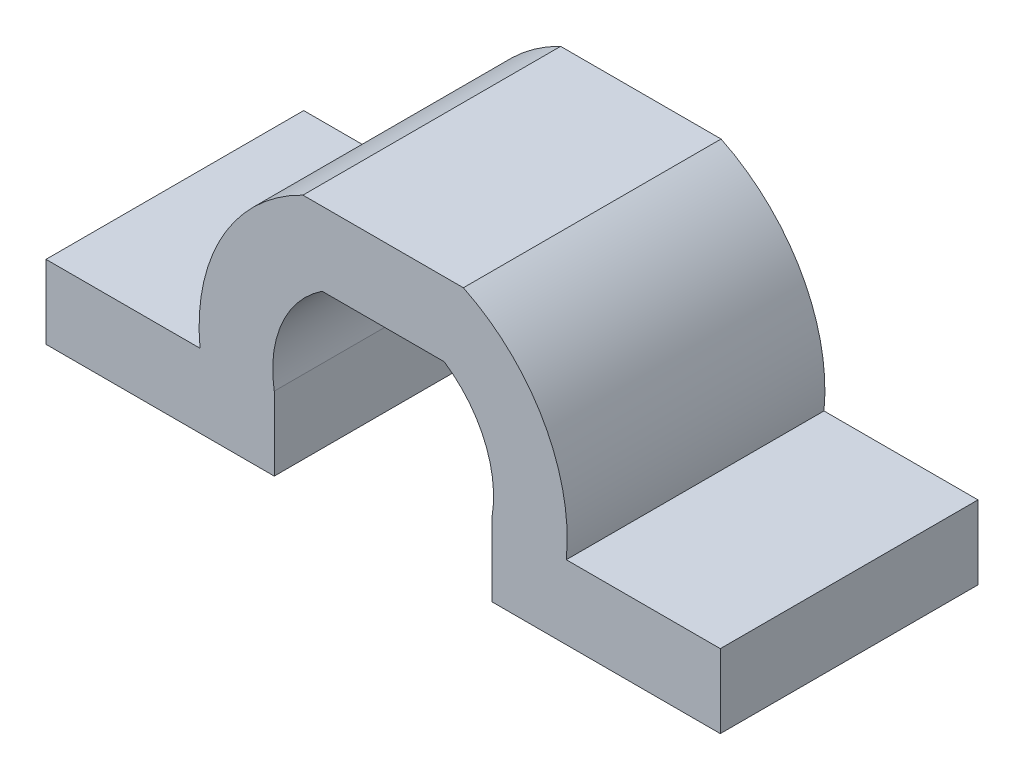
ISO-10303-21;
HEADER;
FILE_DESCRIPTION(('STEP AP214'),'2;1');
FILE_NAME('part.step','',(''),(''),'','','');
FILE_SCHEMA(('AUTOMOTIVE_DESIGN { 1 0 10303 214 1 1 1 1 }'));
ENDSEC;
DATA;
#1=APPLICATION_CONTEXT('core data for automotive mechanical design processes');
#2=APPLICATION_PROTOCOL_DEFINITION('international standard','automotive_design',2000,#1);
#3=PRODUCT_CONTEXT('',#1,'mechanical');
#4=PRODUCT('Part','Part','',(#3));
#5=PRODUCT_RELATED_PRODUCT_CATEGORY('part','',(#4));
#6=PRODUCT_DEFINITION_FORMATION('','',#4);
#7=PRODUCT_DEFINITION_CONTEXT('part definition',#1,'design');
#8=PRODUCT_DEFINITION('design','',#6,#7);
#9=PRODUCT_DEFINITION_SHAPE('','',#8);
#10=(LENGTH_UNIT() NAMED_UNIT(*) SI_UNIT(.MILLI.,.METRE.));
#11=(NAMED_UNIT(*) PLANE_ANGLE_UNIT() SI_UNIT($,.RADIAN.));
#12=(NAMED_UNIT(*) SI_UNIT($,.STERADIAN.) SOLID_ANGLE_UNIT());
#13=UNCERTAINTY_MEASURE_WITH_UNIT(LENGTH_MEASURE(1.E-05),#10,'distance_accuracy_value','');
#14=(GEOMETRIC_REPRESENTATION_CONTEXT(3) GLOBAL_UNCERTAINTY_ASSIGNED_CONTEXT((#13)) GLOBAL_UNIT_ASSIGNED_CONTEXT((#10,
#11,#12)) REPRESENTATION_CONTEXT('',''));
#15=CARTESIAN_POINT('',(0.,0.,0.));
#16=DIRECTION('',(0.,0.,1.));
#17=DIRECTION('',(1.,0.,0.));
#18=AXIS2_PLACEMENT_3D('',#15,#16,#17);
#19=CARTESIAN_POINT('',(0.,-1.,14.));
#20=DIRECTION('',(0.,-1.,0.));
#21=DIRECTION('',(0.,0.,-1.));
#22=AXIS2_PLACEMENT_3D('',#19,#20,#21);
#23=PLANE('',#22);
#24=DIRECTION('',(-1.,0.,0.));
#25=VECTOR('',#24,1.);
#26=CARTESIAN_POINT('',(0.,-1.,0.));
#27=LINE('',#26,#25);
#28=CARTESIAN_POINT('',(18.3166247903554,-1.,0.));
#29=VERTEX_POINT('',#28);
#30=CARTESIAN_POINT('',(9.9498743710662,-1.,0.));
#31=VERTEX_POINT('',#30);
#32=EDGE_CURVE('E177',#29,#31,#27,.T.);
#33=ORIENTED_EDGE('',*,*,#32,.T.);
#34=DIRECTION('',(0.,0.,-1.));
#35=VECTOR('',#34,1.);
#36=CARTESIAN_POINT('',(9.9498743710662,-1.,14.));
#37=LINE('',#36,#35);
#38=CARTESIAN_POINT('',(9.9498743710662,-1.,14.));
#39=VERTEX_POINT('',#38);
#40=EDGE_CURVE('E11',#39,#31,#37,.T.);
#41=ORIENTED_EDGE('',*,*,#40,.F.);
#42=DIRECTION('',(-1.,0.,0.));
#43=VECTOR('',#42,1.);
#44=CARTESIAN_POINT('',(0.,-1.,14.));
#45=LINE('',#44,#43);
#46=CARTESIAN_POINT('',(18.3166247903554,-1.,14.));
#47=VERTEX_POINT('',#46);
#48=EDGE_CURVE('E227',#47,#39,#45,.T.);
#49=ORIENTED_EDGE('',*,*,#48,.F.);
#50=DIRECTION('',(0.,0.,-1.));
#51=VECTOR('',#50,1.);
#52=CARTESIAN_POINT('',(18.3166247903554,-1.,14.));
#53=LINE('',#52,#51);
#54=EDGE_CURVE('E173',#47,#29,#53,.T.);
#55=ORIENTED_EDGE('',*,*,#54,.T.);
#56=EDGE_LOOP('',(#33,#41,#49,#55));
#57=FACE_BOUND('',#56,.T.);
#58=ADVANCED_FACE('F41',(#57),#23,.F.);
#59=CARTESIAN_POINT('',(0.,0.,14.));
#60=DIRECTION('',(0.,0.,-1.));
#61=DIRECTION('',(-1.,0.,0.));
#62=AXIS2_PLACEMENT_3D('',#59,#60,#61);
#63=CYLINDRICAL_SURFACE('',#62,10.);
#64=CARTESIAN_POINT('',(0.,0.,0.));
#65=DIRECTION('',(0.,0.,1.));
#66=DIRECTION('',(1.,0.,0.));
#67=AXIS2_PLACEMENT_3D('',#64,#65,#66);
#68=CIRCLE('',#67,10.);
#69=CARTESIAN_POINT('',(4.35889894354067,9.,0.));
#70=VERTEX_POINT('',#69);
#71=EDGE_CURVE('E181',#31,#70,#68,.T.);
#72=ORIENTED_EDGE('',*,*,#71,.T.);
#73=DIRECTION('',(0.,0.,-1.));
#74=VECTOR('',#73,1.);
#75=CARTESIAN_POINT('',(4.35889894354067,9.,14.));
#76=LINE('',#75,#74);
#77=CARTESIAN_POINT('',(4.35889894354067,9.,14.));
#78=VERTEX_POINT('',#77);
#79=EDGE_CURVE('E50',#78,#70,#76,.T.);
#80=ORIENTED_EDGE('',*,*,#79,.F.);
#81=CARTESIAN_POINT('',(0.,0.,14.));
#82=DIRECTION('',(0.,0.,1.));
#83=DIRECTION('',(1.,0.,0.));
#84=AXIS2_PLACEMENT_3D('',#81,#82,#83);
#85=CIRCLE('',#84,10.);
#86=EDGE_CURVE('E119',#39,#78,#85,.T.);
#87=ORIENTED_EDGE('',*,*,#86,.F.);
#88=ORIENTED_EDGE('',*,*,#40,.T.);
#89=EDGE_LOOP('',(#72,#80,#87,#88));
#90=FACE_BOUND('',#89,.T.);
#91=ADVANCED_FACE('F264',(#90),#63,.T.);
#92=CARTESIAN_POINT('',(0.,9.,14.));
#93=DIRECTION('',(0.,1.,0.));
#94=DIRECTION('',(0.,0.,1.));
#95=AXIS2_PLACEMENT_3D('',#92,#93,#94);
#96=PLANE('',#95);
#97=DIRECTION('',(1.,0.,0.));
#98=VECTOR('',#97,1.);
#99=CARTESIAN_POINT('',(0.,9.,0.));
#100=LINE('',#99,#98);
#101=CARTESIAN_POINT('',(-4.35889894354068,9.,0.));
#102=VERTEX_POINT('',#101);
#103=EDGE_CURVE('E185',#102,#70,#100,.T.);
#104=ORIENTED_EDGE('',*,*,#103,.F.);
#105=DIRECTION('',(0.,0.,-1.));
#106=VECTOR('',#105,1.);
#107=CARTESIAN_POINT('',(-4.35889894354068,9.,14.));
#108=LINE('',#107,#106);
#109=CARTESIAN_POINT('',(-4.35889894354068,9.,14.));
#110=VERTEX_POINT('',#109);
#111=EDGE_CURVE('E255',#110,#102,#108,.T.);
#112=ORIENTED_EDGE('',*,*,#111,.F.);
#113=DIRECTION('',(1.,0.,0.));
#114=VECTOR('',#113,1.);
#115=CARTESIAN_POINT('',(0.,9.,14.));
#116=LINE('',#115,#114);
#117=EDGE_CURVE('E263',#110,#78,#116,.T.);
#118=ORIENTED_EDGE('',*,*,#117,.T.);
#119=ORIENTED_EDGE('',*,*,#79,.T.);
#120=EDGE_LOOP('',(#104,#112,#118,#119));
#121=FACE_BOUND('',#120,.T.);
#122=ADVANCED_FACE('F261',(#121),#96,.T.);
#123=CARTESIAN_POINT('',(0.,0.,14.));
#124=DIRECTION('',(0.,0.,-1.));
#125=DIRECTION('',(-1.,0.,0.));
#126=AXIS2_PLACEMENT_3D('',#123,#124,#125);
#127=CYLINDRICAL_SURFACE('',#126,10.);
#128=CARTESIAN_POINT('',(0.,0.,0.));
#129=DIRECTION('',(0.,0.,1.));
#130=DIRECTION('',(1.,0.,0.));
#131=AXIS2_PLACEMENT_3D('',#128,#129,#130);
#132=CIRCLE('',#131,10.);
#133=CARTESIAN_POINT('',(-9.9498743710662,-1.,0.));
#134=VERTEX_POINT('',#133);
#135=EDGE_CURVE('E189',#102,#134,#132,.T.);
#136=ORIENTED_EDGE('',*,*,#135,.T.);
#137=DIRECTION('',(0.,0.,-1.));
#138=VECTOR('',#137,1.);
#139=CARTESIAN_POINT('',(-9.9498743710662,-1.,14.));
#140=LINE('',#139,#138);
#141=CARTESIAN_POINT('',(-9.9498743710662,-1.,14.));
#142=VERTEX_POINT('',#141);
#143=EDGE_CURVE('E252',#142,#134,#140,.T.);
#144=ORIENTED_EDGE('',*,*,#143,.F.);
#145=CARTESIAN_POINT('',(0.,0.,14.));
#146=DIRECTION('',(0.,0.,1.));
#147=DIRECTION('',(1.,0.,0.));
#148=AXIS2_PLACEMENT_3D('',#145,#146,#147);
#149=CIRCLE('',#148,10.);
#150=EDGE_CURVE('E276',#110,#142,#149,.T.);
#151=ORIENTED_EDGE('',*,*,#150,.F.);
#152=ORIENTED_EDGE('',*,*,#111,.T.);
#153=EDGE_LOOP('',(#136,#144,#151,#152));
#154=FACE_BOUND('',#153,.T.);
#155=ADVANCED_FACE('F273',(#154),#127,.T.);
#156=CARTESIAN_POINT('',(0.,-1.,14.));
#157=DIRECTION('',(0.,1.,0.));
#158=DIRECTION('',(0.,0.,1.));
#159=AXIS2_PLACEMENT_3D('',#156,#157,#158);
#160=PLANE('',#159);
#161=DIRECTION('',(1.,0.,0.));
#162=VECTOR('',#161,1.);
#163=CARTESIAN_POINT('',(0.,-1.,0.));
#164=LINE('',#163,#162);
#165=CARTESIAN_POINT('',(-18.3166247903554,-1.,0.));
#166=VERTEX_POINT('',#165);
#167=EDGE_CURVE('E193',#166,#134,#164,.T.);
#168=ORIENTED_EDGE('',*,*,#167,.F.);
#169=DIRECTION('',(0.,0.,-1.));
#170=VECTOR('',#169,1.);
#171=CARTESIAN_POINT('',(-18.3166247903554,-1.,14.));
#172=LINE('',#171,#170);
#173=CARTESIAN_POINT('',(-18.3166247903554,-1.,14.));
#174=VERTEX_POINT('',#173);
#175=EDGE_CURVE('E249',#174,#166,#172,.T.);
#176=ORIENTED_EDGE('',*,*,#175,.F.);
#177=DIRECTION('',(1.,0.,0.));
#178=VECTOR('',#177,1.);
#179=CARTESIAN_POINT('',(0.,-1.,14.));
#180=LINE('',#179,#178);
#181=EDGE_CURVE('E279',#174,#142,#180,.T.);
#182=ORIENTED_EDGE('',*,*,#181,.T.);
#183=ORIENTED_EDGE('',*,*,#143,.T.);
#184=EDGE_LOOP('',(#168,#176,#182,#183));
#185=FACE_BOUND('',#184,.T.);
#186=ADVANCED_FACE('F336',(#185),#160,.T.);
#187=CARTESIAN_POINT('',(-18.3166247903554,0.,14.));
#188=DIRECTION('',(-1.,0.,0.));
#189=DIRECTION('',(0.,0.,1.));
#190=AXIS2_PLACEMENT_3D('',#187,#188,#189);
#191=PLANE('',#190);
#192=DIRECTION('',(0.,1.,0.));
#193=VECTOR('',#192,1.);
#194=CARTESIAN_POINT('',(-18.3166247903554,0.,0.));
#195=LINE('',#194,#193);
#196=CARTESIAN_POINT('',(-18.3166247903554,-5.,0.));
#197=VERTEX_POINT('',#196);
#198=EDGE_CURVE('E197',#197,#166,#195,.T.);
#199=ORIENTED_EDGE('',*,*,#198,.F.);
#200=DIRECTION('',(0.,0.,-1.));
#201=VECTOR('',#200,1.);
#202=CARTESIAN_POINT('',(-18.3166247903554,-5.,14.));
#203=LINE('',#202,#201);
#204=CARTESIAN_POINT('',(-18.3166247903554,-5.,14.));
#205=VERTEX_POINT('',#204);
#206=EDGE_CURVE('E246',#205,#197,#203,.T.);
#207=ORIENTED_EDGE('',*,*,#206,.F.);
#208=DIRECTION('',(0.,1.,0.));
#209=VECTOR('',#208,1.);
#210=CARTESIAN_POINT('',(-18.3166247903554,0.,14.));
#211=LINE('',#210,#209);
#212=EDGE_CURVE('E289',#205,#174,#211,.T.);
#213=ORIENTED_EDGE('',*,*,#212,.T.);
#214=ORIENTED_EDGE('',*,*,#175,.T.);
#215=EDGE_LOOP('',(#199,#207,#213,#214));
#216=FACE_BOUND('',#215,.T.);
#217=ADVANCED_FACE('F339',(#216),#191,.T.);
#218=CARTESIAN_POINT('',(0.,-5.,14.));
#219=DIRECTION('',(0.,-1.,0.));
#220=DIRECTION('',(1.,0.,0.));
#221=AXIS2_PLACEMENT_3D('',#218,#219,#220);
#222=PLANE('',#221);
#223=DIRECTION('',(-1.,0.,0.));
#224=VECTOR('',#223,1.);
#225=CARTESIAN_POINT('',(0.,-5.,0.));
#226=LINE('',#225,#224);
#227=CARTESIAN_POINT('',(-5.91607978309962,-5.,0.));
#228=VERTEX_POINT('',#227);
#229=EDGE_CURVE('E201',#228,#197,#226,.T.);
#230=ORIENTED_EDGE('',*,*,#229,.F.);
#231=DIRECTION('',(0.,0.,-1.));
#232=VECTOR('',#231,1.);
#233=CARTESIAN_POINT('',(-5.91607978309962,-5.,14.));
#234=LINE('',#233,#232);
#235=CARTESIAN_POINT('',(-5.91607978309962,-5.,14.));
#236=VERTEX_POINT('',#235);
#237=EDGE_CURVE('E243',#236,#228,#234,.T.);
#238=ORIENTED_EDGE('',*,*,#237,.F.);
#239=DIRECTION('',(-1.,0.,0.));
#240=VECTOR('',#239,1.);
#241=CARTESIAN_POINT('',(0.,-5.,14.));
#242=LINE('',#241,#240);
#243=EDGE_CURVE('E293',#236,#205,#242,.T.);
#244=ORIENTED_EDGE('',*,*,#243,.T.);
#245=ORIENTED_EDGE('',*,*,#206,.T.);
#246=EDGE_LOOP('',(#230,#238,#244,#245));
#247=FACE_BOUND('',#246,.T.);
#248=ADVANCED_FACE('F343',(#247),#222,.T.);
#249=CARTESIAN_POINT('',(-5.91607978309962,0.,14.));
#250=DIRECTION('',(1.,0.,0.));
#251=DIRECTION('',(0.,0.,-1.));
#252=AXIS2_PLACEMENT_3D('',#249,#250,#251);
#253=PLANE('',#252);
#254=DIRECTION('',(0.,-1.,0.));
#255=VECTOR('',#254,1.);
#256=CARTESIAN_POINT('',(-5.91607978309962,0.,0.));
#257=LINE('',#256,#255);
#258=CARTESIAN_POINT('',(-5.91607978309962,-1.,0.));
#259=VERTEX_POINT('',#258);
#260=EDGE_CURVE('E205',#259,#228,#257,.T.);
#261=ORIENTED_EDGE('',*,*,#260,.F.);
#262=DIRECTION('',(0.,0.,-1.));
#263=VECTOR('',#262,1.);
#264=CARTESIAN_POINT('',(-5.91607978309962,-1.,14.));
#265=LINE('',#264,#263);
#266=CARTESIAN_POINT('',(-5.91607978309962,-1.,14.));
#267=VERTEX_POINT('',#266);
#268=EDGE_CURVE('E240',#267,#259,#265,.T.);
#269=ORIENTED_EDGE('',*,*,#268,.F.);
#270=DIRECTION('',(0.,-1.,0.));
#271=VECTOR('',#270,1.);
#272=CARTESIAN_POINT('',(-5.91607978309962,0.,14.));
#273=LINE('',#272,#271);
#274=EDGE_CURVE('E297',#267,#236,#273,.T.);
#275=ORIENTED_EDGE('',*,*,#274,.T.);
#276=ORIENTED_EDGE('',*,*,#237,.T.);
#277=EDGE_LOOP('',(#261,#269,#275,#276));
#278=FACE_BOUND('',#277,.T.);
#279=ADVANCED_FACE('F347',(#278),#253,.T.);
#280=CARTESIAN_POINT('',(0.,0.,14.));
#281=DIRECTION('',(0.,0.,-1.));
#282=DIRECTION('',(-1.,0.,0.));
#283=AXIS2_PLACEMENT_3D('',#280,#281,#282);
#284=CYLINDRICAL_SURFACE('',#283,6.);
#285=CARTESIAN_POINT('',(0.,0.,0.));
#286=DIRECTION('',(0.,0.,1.));
#287=DIRECTION('',(1.,0.,0.));
#288=AXIS2_PLACEMENT_3D('',#285,#286,#287);
#289=CIRCLE('',#288,6.);
#290=CARTESIAN_POINT('',(-3.3166247903554,5.,0.));
#291=VERTEX_POINT('',#290);
#292=EDGE_CURVE('E209',#291,#259,#289,.T.);
#293=ORIENTED_EDGE('',*,*,#292,.F.);
#294=DIRECTION('',(0.,0.,-1.));
#295=VECTOR('',#294,1.);
#296=CARTESIAN_POINT('',(-3.3166247903554,5.,14.));
#297=LINE('',#296,#295);
#298=CARTESIAN_POINT('',(-3.3166247903554,5.,14.));
#299=VERTEX_POINT('',#298);
#300=EDGE_CURVE('E237',#299,#291,#297,.T.);
#301=ORIENTED_EDGE('',*,*,#300,.F.);
#302=CARTESIAN_POINT('',(0.,0.,14.));
#303=DIRECTION('',(0.,0.,1.));
#304=DIRECTION('',(1.,0.,0.));
#305=AXIS2_PLACEMENT_3D('',#302,#303,#304);
#306=CIRCLE('',#305,6.);
#307=EDGE_CURVE('E301',#299,#267,#306,.T.);
#308=ORIENTED_EDGE('',*,*,#307,.T.);
#309=ORIENTED_EDGE('',*,*,#268,.T.);
#310=EDGE_LOOP('',(#293,#301,#308,#309));
#311=FACE_BOUND('',#310,.T.);
#312=ADVANCED_FACE('F351',(#311),#284,.F.);
#313=CARTESIAN_POINT('',(0.,5.,14.));
#314=DIRECTION('',(0.,1.,0.));
#315=DIRECTION('',(0.,0.,1.));
#316=AXIS2_PLACEMENT_3D('',#313,#314,#315);
#317=PLANE('',#316);
#318=DIRECTION('',(1.,0.,0.));
#319=VECTOR('',#318,1.);
#320=CARTESIAN_POINT('',(0.,5.,0.));
#321=LINE('',#320,#319);
#322=CARTESIAN_POINT('',(3.3166247903554,5.,0.));
#323=VERTEX_POINT('',#322);
#324=EDGE_CURVE('E213',#291,#323,#321,.T.);
#325=ORIENTED_EDGE('',*,*,#324,.T.);
#326=DIRECTION('',(0.,0.,-1.));
#327=VECTOR('',#326,1.);
#328=CARTESIAN_POINT('',(3.3166247903554,5.,14.));
#329=LINE('',#328,#327);
#330=CARTESIAN_POINT('',(3.3166247903554,5.,14.));
#331=VERTEX_POINT('',#330);
#332=EDGE_CURVE('E234',#331,#323,#329,.T.);
#333=ORIENTED_EDGE('',*,*,#332,.F.);
#334=DIRECTION('',(1.,0.,0.));
#335=VECTOR('',#334,1.);
#336=CARTESIAN_POINT('',(0.,5.,14.));
#337=LINE('',#336,#335);
#338=EDGE_CURVE('E305',#299,#331,#337,.T.);
#339=ORIENTED_EDGE('',*,*,#338,.F.);
#340=ORIENTED_EDGE('',*,*,#300,.T.);
#341=EDGE_LOOP('',(#325,#333,#339,#340));
#342=FACE_BOUND('',#341,.T.);
#343=ADVANCED_FACE('F355',(#342),#317,.F.);
#344=CARTESIAN_POINT('',(0.,0.,14.));
#345=DIRECTION('',(0.,0.,-1.));
#346=DIRECTION('',(-1.,0.,0.));
#347=AXIS2_PLACEMENT_3D('',#344,#345,#346);
#348=CYLINDRICAL_SURFACE('',#347,6.);
#349=CARTESIAN_POINT('',(0.,0.,0.));
#350=DIRECTION('',(0.,0.,1.));
#351=DIRECTION('',(1.,0.,0.));
#352=AXIS2_PLACEMENT_3D('',#349,#350,#351);
#353=CIRCLE('',#352,6.);
#354=CARTESIAN_POINT('',(5.91607978309962,-1.,0.));
#355=VERTEX_POINT('',#354);
#356=EDGE_CURVE('E217',#355,#323,#353,.T.);
#357=ORIENTED_EDGE('',*,*,#356,.F.);
#358=DIRECTION('',(0.,0.,-1.));
#359=VECTOR('',#358,1.);
#360=CARTESIAN_POINT('',(5.91607978309962,-1.,14.));
#361=LINE('',#360,#359);
#362=CARTESIAN_POINT('',(5.91607978309962,-1.,14.));
#363=VERTEX_POINT('',#362);
#364=EDGE_CURVE('E166',#363,#355,#361,.T.);
#365=ORIENTED_EDGE('',*,*,#364,.F.);
#366=CARTESIAN_POINT('',(0.,0.,14.));
#367=DIRECTION('',(0.,0.,1.));
#368=DIRECTION('',(1.,0.,0.));
#369=AXIS2_PLACEMENT_3D('',#366,#367,#368);
#370=CIRCLE('',#369,6.);
#371=EDGE_CURVE('E157',#363,#331,#370,.T.);
#372=ORIENTED_EDGE('',*,*,#371,.T.);
#373=ORIENTED_EDGE('',*,*,#332,.T.);
#374=EDGE_LOOP('',(#357,#365,#372,#373));
#375=FACE_BOUND('',#374,.T.);
#376=ADVANCED_FACE('F310',(#375),#348,.F.);
#377=CARTESIAN_POINT('',(5.91607978309962,0.,14.));
#378=DIRECTION('',(1.,0.,0.));
#379=DIRECTION('',(0.,0.,-1.));
#380=AXIS2_PLACEMENT_3D('',#377,#378,#379);
#381=PLANE('',#380);
#382=DIRECTION('',(0.,-1.,0.));
#383=VECTOR('',#382,1.);
#384=CARTESIAN_POINT('',(5.91607978309962,0.,0.));
#385=LINE('',#384,#383);
#386=CARTESIAN_POINT('',(5.91607978309962,-5.,0.));
#387=VERTEX_POINT('',#386);
#388=EDGE_CURVE('E164',#355,#387,#385,.T.);
#389=ORIENTED_EDGE('',*,*,#388,.T.);
#390=DIRECTION('',(0.,0.,-1.));
#391=VECTOR('',#390,1.);
#392=CARTESIAN_POINT('',(5.91607978309962,-5.,14.));
#393=LINE('',#392,#391);
#394=CARTESIAN_POINT('',(5.91607978309962,-5.,14.));
#395=VERTEX_POINT('',#394);
#396=EDGE_CURVE('E161',#395,#387,#393,.T.);
#397=ORIENTED_EDGE('',*,*,#396,.F.);
#398=DIRECTION('',(0.,-1.,0.));
#399=VECTOR('',#398,1.);
#400=CARTESIAN_POINT('',(5.91607978309962,0.,14.));
#401=LINE('',#400,#399);
#402=EDGE_CURVE('E151',#363,#395,#401,.T.);
#403=ORIENTED_EDGE('',*,*,#402,.F.);
#404=ORIENTED_EDGE('',*,*,#364,.T.);
#405=EDGE_LOOP('',(#389,#397,#403,#404));
#406=FACE_BOUND('',#405,.T.);
#407=ADVANCED_FACE('F162',(#406),#381,.F.);
#408=CARTESIAN_POINT('',(0.,-5.,14.));
#409=DIRECTION('',(0.,1.,0.));
#410=DIRECTION('',(-1.,0.,0.));
#411=AXIS2_PLACEMENT_3D('',#408,#409,#410);
#412=PLANE('',#411);
#413=DIRECTION('',(1.,0.,0.));
#414=VECTOR('',#413,1.);
#415=CARTESIAN_POINT('',(0.,-5.,0.));
#416=LINE('',#415,#414);
#417=CARTESIAN_POINT('',(18.3166247903554,-5.,0.));
#418=VERTEX_POINT('',#417);
#419=EDGE_CURVE('E105',#387,#418,#416,.T.);
#420=ORIENTED_EDGE('',*,*,#419,.T.);
#421=DIRECTION('',(0.,0.,-1.));
#422=VECTOR('',#421,1.);
#423=CARTESIAN_POINT('',(18.3166247903554,-5.,14.));
#424=LINE('',#423,#422);
#425=CARTESIAN_POINT('',(18.3166247903554,-5.,14.));
#426=VERTEX_POINT('',#425);
#427=EDGE_CURVE('E167',#426,#418,#424,.T.);
#428=ORIENTED_EDGE('',*,*,#427,.F.);
#429=DIRECTION('',(1.,0.,0.));
#430=VECTOR('',#429,1.);
#431=CARTESIAN_POINT('',(0.,-5.,14.));
#432=LINE('',#431,#430);
#433=EDGE_CURVE('E155',#395,#426,#432,.T.);
#434=ORIENTED_EDGE('',*,*,#433,.F.);
#435=ORIENTED_EDGE('',*,*,#396,.T.);
#436=EDGE_LOOP('',(#420,#428,#434,#435));
#437=FACE_BOUND('',#436,.T.);
#438=ADVANCED_FACE('F169',(#437),#412,.F.);
#439=CARTESIAN_POINT('',(18.3166247903554,0.,14.));
#440=DIRECTION('',(-1.,0.,0.));
#441=DIRECTION('',(0.,0.,1.));
#442=AXIS2_PLACEMENT_3D('',#439,#440,#441);
#443=PLANE('',#442);
#444=DIRECTION('',(0.,1.,0.));
#445=VECTOR('',#444,1.);
#446=CARTESIAN_POINT('',(18.3166247903554,0.,0.));
#447=LINE('',#446,#445);
#448=EDGE_CURVE('E111',#418,#29,#447,.T.);
#449=ORIENTED_EDGE('',*,*,#448,.T.);
#450=ORIENTED_EDGE('',*,*,#54,.F.);
#451=DIRECTION('',(0.,1.,0.));
#452=VECTOR('',#451,1.);
#453=CARTESIAN_POINT('',(18.3166247903554,0.,14.));
#454=LINE('',#453,#452);
#455=EDGE_CURVE('E58',#426,#47,#454,.T.);
#456=ORIENTED_EDGE('',*,*,#455,.F.);
#457=ORIENTED_EDGE('',*,*,#427,.T.);
#458=EDGE_LOOP('',(#449,#450,#456,#457));
#459=FACE_BOUND('',#458,.T.);
#460=ADVANCED_FACE('F315',(#459),#443,.F.);
#461=CARTESIAN_POINT('',(0.,0.,14.));
#462=DIRECTION('',(0.,0.,1.));
#463=DIRECTION('',(1.,0.,0.));
#464=AXIS2_PLACEMENT_3D('',#461,#462,#463);
#465=PLANE('',#464);
#466=ORIENTED_EDGE('',*,*,#48,.T.);
#467=ORIENTED_EDGE('',*,*,#86,.T.);
#468=ORIENTED_EDGE('',*,*,#117,.F.);
#469=ORIENTED_EDGE('',*,*,#150,.T.);
#470=ORIENTED_EDGE('',*,*,#181,.F.);
#471=ORIENTED_EDGE('',*,*,#212,.F.);
#472=ORIENTED_EDGE('',*,*,#243,.F.);
#473=ORIENTED_EDGE('',*,*,#274,.F.);
#474=ORIENTED_EDGE('',*,*,#307,.F.);
#475=ORIENTED_EDGE('',*,*,#338,.T.);
#476=ORIENTED_EDGE('',*,*,#371,.F.);
#477=ORIENTED_EDGE('',*,*,#402,.T.);
#478=ORIENTED_EDGE('',*,*,#433,.T.);
#479=ORIENTED_EDGE('',*,*,#455,.T.);
#480=EDGE_LOOP('',(#466,#467,#468,#469,#470,#471,#472,#473,#474,#475,#476,#477,#478,#479));
#481=FACE_BOUND('',#480,.T.);
#482=ADVANCED_FACE('F153',(#481),#465,.T.);
#483=CARTESIAN_POINT('',(0.,0.,0.));
#484=DIRECTION('',(0.,0.,1.));
#485=DIRECTION('',(1.,0.,0.));
#486=AXIS2_PLACEMENT_3D('',#483,#484,#485);
#487=PLANE('',#486);
#488=ORIENTED_EDGE('',*,*,#32,.F.);
#489=ORIENTED_EDGE('',*,*,#448,.F.);
#490=ORIENTED_EDGE('',*,*,#419,.F.);
#491=ORIENTED_EDGE('',*,*,#388,.F.);
#492=ORIENTED_EDGE('',*,*,#356,.T.);
#493=ORIENTED_EDGE('',*,*,#324,.F.);
#494=ORIENTED_EDGE('',*,*,#292,.T.);
#495=ORIENTED_EDGE('',*,*,#260,.T.);
#496=ORIENTED_EDGE('',*,*,#229,.T.);
#497=ORIENTED_EDGE('',*,*,#198,.T.);
#498=ORIENTED_EDGE('',*,*,#167,.T.);
#499=ORIENTED_EDGE('',*,*,#135,.F.);
#500=ORIENTED_EDGE('',*,*,#103,.T.);
#501=ORIENTED_EDGE('',*,*,#71,.F.);
#502=EDGE_LOOP('',(#488,#489,#490,#491,#492,#493,#494,#495,#496,#497,#498,#499,#500,#501));
#503=FACE_BOUND('',#502,.T.);
#504=ADVANCED_FACE('F269',(#503),#487,.F.);
#505=CLOSED_SHELL('',(#58,#91,#122,#155,#186,#217,#248,#279,#312,#343,#376,#407,#438,#460,#482,#504));
#506=MANIFOLD_SOLID_BREP('B2',#505);
#507=ADVANCED_BREP_SHAPE_REPRESENTATION('',(#18,#506),#14);
#508=SHAPE_DEFINITION_REPRESENTATION(#9,#507);
ENDSEC;
END-ISO-10303-21;
